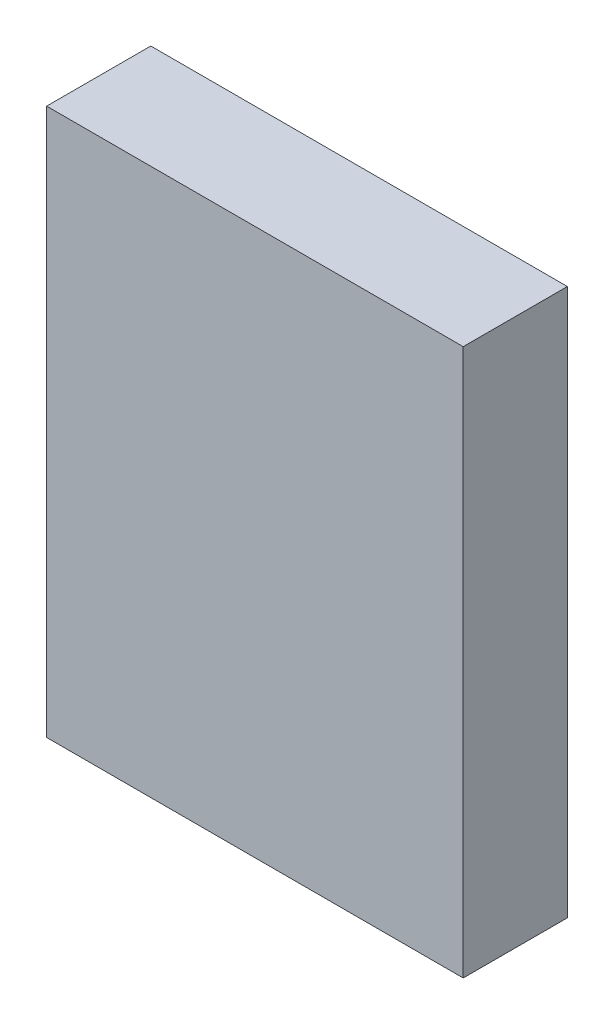
ISO-10303-21;
HEADER;
FILE_DESCRIPTION(('STEP AP214'),'2;1');
FILE_NAME('part.step','',(''),(''),'','','');
FILE_SCHEMA(('AUTOMOTIVE_DESIGN { 1 0 10303 214 1 1 1 1 }'));
ENDSEC;
DATA;
#1=APPLICATION_CONTEXT('core data for automotive mechanical design processes');
#2=APPLICATION_PROTOCOL_DEFINITION('international standard','automotive_design',2000,#1);
#3=PRODUCT_CONTEXT('',#1,'mechanical');
#4=PRODUCT('Part','Part','',(#3));
#5=PRODUCT_RELATED_PRODUCT_CATEGORY('part','',(#4));
#6=PRODUCT_DEFINITION_FORMATION('','',#4);
#7=PRODUCT_DEFINITION_CONTEXT('part definition',#1,'design');
#8=PRODUCT_DEFINITION('design','',#6,#7);
#9=PRODUCT_DEFINITION_SHAPE('','',#8);
#10=(LENGTH_UNIT() NAMED_UNIT(*) SI_UNIT(.MILLI.,.METRE.));
#11=(NAMED_UNIT(*) PLANE_ANGLE_UNIT() SI_UNIT($,.RADIAN.));
#12=(NAMED_UNIT(*) SI_UNIT($,.STERADIAN.) SOLID_ANGLE_UNIT());
#13=UNCERTAINTY_MEASURE_WITH_UNIT(LENGTH_MEASURE(1.E-05),#10,'distance_accuracy_value','');
#14=(GEOMETRIC_REPRESENTATION_CONTEXT(3) GLOBAL_UNCERTAINTY_ASSIGNED_CONTEXT((#13)) GLOBAL_UNIT_ASSIGNED_CONTEXT((#10,
#11,#12)) REPRESENTATION_CONTEXT('',''));
#15=CARTESIAN_POINT('',(0.,0.,0.));
#16=DIRECTION('',(0.,0.,1.));
#17=DIRECTION('',(1.,0.,0.));
#18=AXIS2_PLACEMENT_3D('',#15,#16,#17);
#19=CARTESIAN_POINT('',(-1.825,2.3005,0.));
#20=DIRECTION('',(1.,0.,0.));
#21=DIRECTION('',(0.,0.,1.));
#22=AXIS2_PLACEMENT_3D('',#19,#20,#21);
#23=PLANE('',#22);
#24=DIRECTION('',(0.,1.,0.));
#25=VECTOR('',#24,1.);
#26=CARTESIAN_POINT('',(-1.825,2.3005,0.1));
#27=LINE('',#26,#25);
#28=CARTESIAN_POINT('',(-1.825,2.3005,0.1));
#29=VERTEX_POINT('',#28);
#30=CARTESIAN_POINT('',(-1.825,2.8255,0.1));
#31=VERTEX_POINT('',#30);
#32=EDGE_CURVE('E11',#29,#31,#27,.T.);
#33=ORIENTED_EDGE('',*,*,#32,.T.);
#34=DIRECTION('',(0.,0.,1.));
#35=VECTOR('',#34,1.);
#36=CARTESIAN_POINT('',(-1.825,2.8255,0.));
#37=LINE('',#36,#35);
#38=CARTESIAN_POINT('',(-1.825,2.8255,0.));
#39=VERTEX_POINT('',#38);
#40=EDGE_CURVE('E24',#39,#31,#37,.T.);
#41=ORIENTED_EDGE('',*,*,#40,.F.);
#42=DIRECTION('',(0.,1.,0.));
#43=VECTOR('',#42,1.);
#44=CARTESIAN_POINT('',(-1.825,2.3005,0.));
#45=LINE('',#44,#43);
#46=CARTESIAN_POINT('',(-1.825,2.3005,0.));
#47=VERTEX_POINT('',#46);
#48=EDGE_CURVE('E86',#47,#39,#45,.T.);
#49=ORIENTED_EDGE('',*,*,#48,.F.);
#50=DIRECTION('',(0.,0.,1.));
#51=VECTOR('',#50,1.);
#52=CARTESIAN_POINT('',(-1.825,2.3005,0.));
#53=LINE('',#52,#51);
#54=EDGE_CURVE('E36',#47,#29,#53,.T.);
#55=ORIENTED_EDGE('',*,*,#54,.T.);
#56=EDGE_LOOP('',(#33,#41,#49,#55));
#57=FACE_BOUND('',#56,.T.);
#58=ADVANCED_FACE('F17',(#57),#23,.F.);
#59=CARTESIAN_POINT('',(-1.425,2.3005,0.));
#60=DIRECTION('',(1.,0.,0.));
#61=DIRECTION('',(0.,0.,1.));
#62=AXIS2_PLACEMENT_3D('',#59,#60,#61);
#63=PLANE('',#62);
#64=DIRECTION('',(0.,0.,1.));
#65=VECTOR('',#64,1.);
#66=CARTESIAN_POINT('',(-1.425,2.3005,0.));
#67=LINE('',#66,#65);
#68=CARTESIAN_POINT('',(-1.425,2.3005,0.));
#69=VERTEX_POINT('',#68);
#70=CARTESIAN_POINT('',(-1.425,2.3005,0.1));
#71=VERTEX_POINT('',#70);
#72=EDGE_CURVE('E83',#69,#71,#67,.T.);
#73=ORIENTED_EDGE('',*,*,#72,.F.);
#74=DIRECTION('',(0.,1.,0.));
#75=VECTOR('',#74,1.);
#76=CARTESIAN_POINT('',(-1.425,2.3005,0.));
#77=LINE('',#76,#75);
#78=CARTESIAN_POINT('',(-1.425,2.8255,0.));
#79=VERTEX_POINT('',#78);
#80=EDGE_CURVE('E63',#69,#79,#77,.T.);
#81=ORIENTED_EDGE('',*,*,#80,.T.);
#82=DIRECTION('',(0.,0.,1.));
#83=VECTOR('',#82,1.);
#84=CARTESIAN_POINT('',(-1.425,2.8255,0.));
#85=LINE('',#84,#83);
#86=CARTESIAN_POINT('',(-1.425,2.8255,0.1));
#87=VERTEX_POINT('',#86);
#88=EDGE_CURVE('E57',#79,#87,#85,.T.);
#89=ORIENTED_EDGE('',*,*,#88,.T.);
#90=DIRECTION('',(0.,1.,0.));
#91=VECTOR('',#90,1.);
#92=CARTESIAN_POINT('',(-1.425,2.3005,0.1));
#93=LINE('',#92,#91);
#94=EDGE_CURVE('E60',#71,#87,#93,.T.);
#95=ORIENTED_EDGE('',*,*,#94,.F.);
#96=EDGE_LOOP('',(#73,#81,#89,#95));
#97=FACE_BOUND('',#96,.T.);
#98=ADVANCED_FACE('F59',(#97),#63,.T.);
#99=CARTESIAN_POINT('',(-1.825,2.3005,0.));
#100=DIRECTION('',(0.,1.,0.));
#101=DIRECTION('',(0.,0.,1.));
#102=AXIS2_PLACEMENT_3D('',#99,#100,#101);
#103=PLANE('',#102);
#104=ORIENTED_EDGE('',*,*,#72,.T.);
#105=DIRECTION('',(1.,0.,0.));
#106=VECTOR('',#105,1.);
#107=CARTESIAN_POINT('',(-1.825,2.3005,0.1));
#108=LINE('',#107,#106);
#109=EDGE_CURVE('E71',#29,#71,#108,.T.);
#110=ORIENTED_EDGE('',*,*,#109,.F.);
#111=ORIENTED_EDGE('',*,*,#54,.F.);
#112=DIRECTION('',(1.,0.,0.));
#113=VECTOR('',#112,1.);
#114=CARTESIAN_POINT('',(-1.825,2.3005,0.));
#115=LINE('',#114,#113);
#116=EDGE_CURVE('E76',#47,#69,#115,.T.);
#117=ORIENTED_EDGE('',*,*,#116,.T.);
#118=EDGE_LOOP('',(#104,#110,#111,#117));
#119=FACE_BOUND('',#118,.T.);
#120=ADVANCED_FACE('F91',(#119),#103,.F.);
#121=CARTESIAN_POINT('',(-1.825,2.8255,0.));
#122=DIRECTION('',(0.,1.,0.));
#123=DIRECTION('',(0.,0.,1.));
#124=AXIS2_PLACEMENT_3D('',#121,#122,#123);
#125=PLANE('',#124);
#126=DIRECTION('',(1.,0.,0.));
#127=VECTOR('',#126,1.);
#128=CARTESIAN_POINT('',(-1.825,2.8255,0.));
#129=LINE('',#128,#127);
#130=EDGE_CURVE('E74',#39,#79,#129,.T.);
#131=ORIENTED_EDGE('',*,*,#130,.F.);
#132=ORIENTED_EDGE('',*,*,#40,.T.);
#133=DIRECTION('',(1.,0.,0.));
#134=VECTOR('',#133,1.);
#135=CARTESIAN_POINT('',(-1.825,2.8255,0.1));
#136=LINE('',#135,#134);
#137=EDGE_CURVE('E69',#31,#87,#136,.T.);
#138=ORIENTED_EDGE('',*,*,#137,.T.);
#139=ORIENTED_EDGE('',*,*,#88,.F.);
#140=EDGE_LOOP('',(#131,#132,#138,#139));
#141=FACE_BOUND('',#140,.T.);
#142=ADVANCED_FACE('F73',(#141),#125,.T.);
#143=CARTESIAN_POINT('',(-1.825,2.3005,0.));
#144=DIRECTION('',(0.,0.,1.));
#145=DIRECTION('',(1.,0.,0.));
#146=AXIS2_PLACEMENT_3D('',#143,#144,#145);
#147=PLANE('',#146);
#148=ORIENTED_EDGE('',*,*,#130,.T.);
#149=ORIENTED_EDGE('',*,*,#80,.F.);
#150=ORIENTED_EDGE('',*,*,#116,.F.);
#151=ORIENTED_EDGE('',*,*,#48,.T.);
#152=EDGE_LOOP('',(#148,#149,#150,#151));
#153=FACE_BOUND('',#152,.T.);
#154=ADVANCED_FACE('F89',(#153),#147,.F.);
#155=CARTESIAN_POINT('',(-1.825,2.3005,0.1));
#156=DIRECTION('',(0.,0.,1.));
#157=DIRECTION('',(1.,0.,0.));
#158=AXIS2_PLACEMENT_3D('',#155,#156,#157);
#159=PLANE('',#158);
#160=ORIENTED_EDGE('',*,*,#32,.F.);
#161=ORIENTED_EDGE('',*,*,#109,.T.);
#162=ORIENTED_EDGE('',*,*,#94,.T.);
#163=ORIENTED_EDGE('',*,*,#137,.F.);
#164=EDGE_LOOP('',(#160,#161,#162,#163));
#165=FACE_BOUND('',#164,.T.);
#166=ADVANCED_FACE('F68',(#165),#159,.T.);
#167=CLOSED_SHELL('',(#58,#98,#120,#142,#154,#166));
#168=MANIFOLD_SOLID_BREP('B1',#167);
#169=ADVANCED_BREP_SHAPE_REPRESENTATION('',(#18,#168),#14);
#170=SHAPE_DEFINITION_REPRESENTATION(#9,#169);
ENDSEC;
END-ISO-10303-21;
